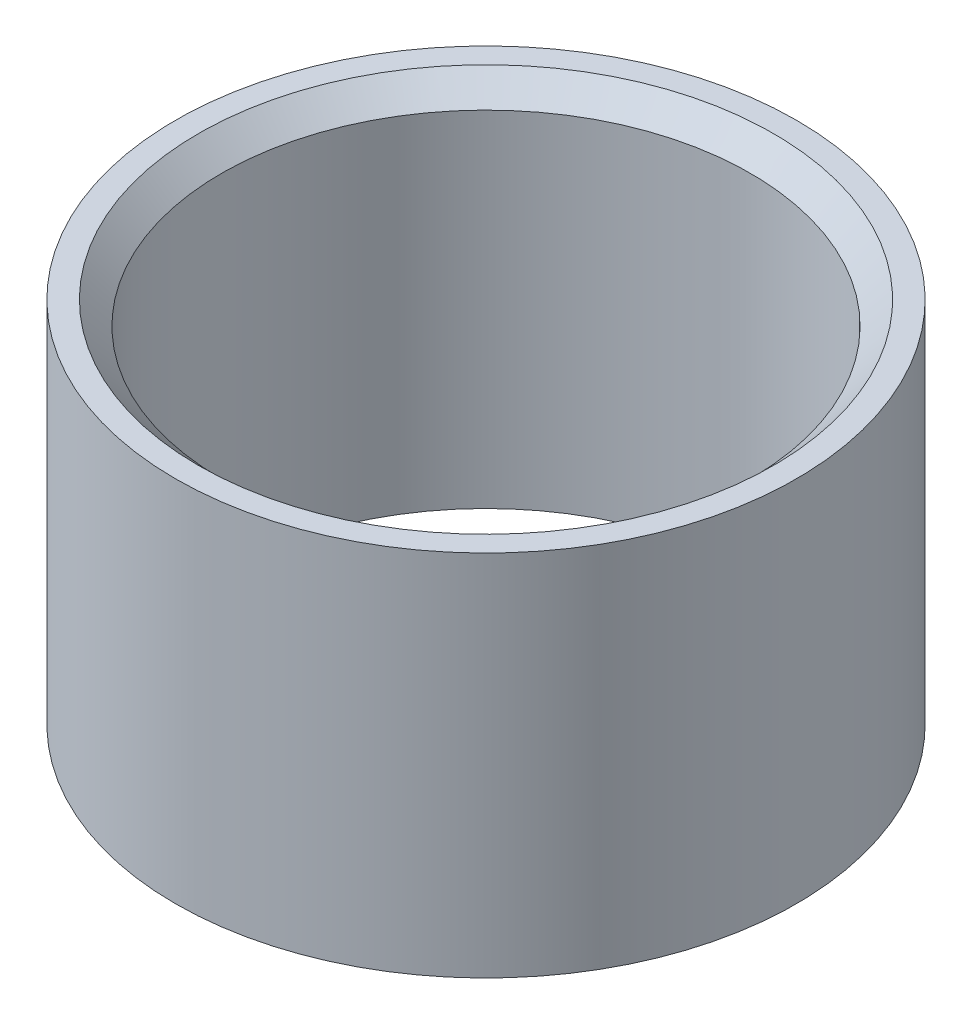
ISO-10303-21;
HEADER;
FILE_DESCRIPTION(('STEP AP214'),'2;1');
FILE_NAME('part.step','',(''),(''),'','','');
FILE_SCHEMA(('AUTOMOTIVE_DESIGN { 1 0 10303 214 1 1 1 1 }'));
ENDSEC;
DATA;
#1=APPLICATION_CONTEXT('core data for automotive mechanical design processes');
#2=APPLICATION_PROTOCOL_DEFINITION('international standard','automotive_design',2000,#1);
#3=PRODUCT_CONTEXT('',#1,'mechanical');
#4=PRODUCT('Part','Part','',(#3));
#5=PRODUCT_RELATED_PRODUCT_CATEGORY('part','',(#4));
#6=PRODUCT_DEFINITION_FORMATION('','',#4);
#7=PRODUCT_DEFINITION_CONTEXT('part definition',#1,'design');
#8=PRODUCT_DEFINITION('design','',#6,#7);
#9=PRODUCT_DEFINITION_SHAPE('','',#8);
#10=(LENGTH_UNIT() NAMED_UNIT(*) SI_UNIT(.MILLI.,.METRE.));
#11=(NAMED_UNIT(*) PLANE_ANGLE_UNIT() SI_UNIT($,.RADIAN.));
#12=(NAMED_UNIT(*) SI_UNIT($,.STERADIAN.) SOLID_ANGLE_UNIT());
#13=UNCERTAINTY_MEASURE_WITH_UNIT(LENGTH_MEASURE(1.E-05),#10,'distance_accuracy_value','');
#14=(GEOMETRIC_REPRESENTATION_CONTEXT(3) GLOBAL_UNCERTAINTY_ASSIGNED_CONTEXT((#13)) GLOBAL_UNIT_ASSIGNED_CONTEXT((#10,
#11,#12)) REPRESENTATION_CONTEXT('',''));
#15=CARTESIAN_POINT('',(0.,0.,0.));
#16=DIRECTION('',(0.,0.,1.));
#17=DIRECTION('',(1.,0.,0.));
#18=AXIS2_PLACEMENT_3D('',#15,#16,#17);
#19=CARTESIAN_POINT('',(0.,1.6,0.));
#20=DIRECTION('',(0.,-1.,0.));
#21=DIRECTION('',(0.,0.,-1.));
#22=AXIS2_PLACEMENT_3D('',#19,#20,#21);
#23=CYLINDRICAL_SURFACE('',#22,1.35);
#24=CARTESIAN_POINT('',(0.,1.6,0.));
#25=DIRECTION('',(0.,1.,0.));
#26=DIRECTION('',(0.,0.,1.));
#27=AXIS2_PLACEMENT_3D('',#24,#25,#26);
#28=CIRCLE('',#27,1.35);
#29=CARTESIAN_POINT('',(0.,1.6,1.35));
#30=VERTEX_POINT('',#29);
#31=EDGE_CURVE('E45',#30,#30,#28,.T.);
#32=ORIENTED_EDGE('',*,*,#31,.F.);
#33=EDGE_LOOP('',(#32));
#34=FACE_BOUND('',#33,.T.);
#35=CARTESIAN_POINT('',(0.,0.,0.));
#36=DIRECTION('',(0.,1.,0.));
#37=DIRECTION('',(0.,0.,1.));
#38=AXIS2_PLACEMENT_3D('',#35,#36,#37);
#39=CIRCLE('',#38,1.35);
#40=CARTESIAN_POINT('',(0.,0.,1.35));
#41=VERTEX_POINT('',#40);
#42=EDGE_CURVE('E49',#41,#41,#39,.T.);
#43=ORIENTED_EDGE('',*,*,#42,.T.);
#44=EDGE_LOOP('',(#43));
#45=FACE_BOUND('',#44,.T.);
#46=ADVANCED_FACE('F34',(#34,#45),#23,.T.);
#47=CARTESIAN_POINT('',(0.,1.6,0.));
#48=DIRECTION('',(0.,1.,0.));
#49=DIRECTION('',(0.,0.,1.));
#50=AXIS2_PLACEMENT_3D('',#47,#48,#49);
#51=PLANE('',#50);
#52=CARTESIAN_POINT('',(0.,1.6,0.));
#53=DIRECTION('',(0.,1.,0.));
#54=DIRECTION('',(0.,0.,1.));
#55=AXIS2_PLACEMENT_3D('',#52,#53,#54);
#56=CIRCLE('',#55,1.25);
#57=CARTESIAN_POINT('',(0.,1.6,1.25));
#58=VERTEX_POINT('',#57);
#59=EDGE_CURVE('E10',#58,#58,#56,.F.);
#60=ORIENTED_EDGE('',*,*,#59,.T.);
#61=EDGE_LOOP('',(#60));
#62=FACE_BOUND('',#61,.T.);
#63=ORIENTED_EDGE('',*,*,#31,.T.);
#64=EDGE_LOOP('',(#63));
#65=FACE_BOUND('',#64,.T.);
#66=ADVANCED_FACE('F69',(#62,#65),#51,.T.);
#67=CARTESIAN_POINT('',(0.,0.,0.));
#68=DIRECTION('',(0.,1.,0.));
#69=DIRECTION('',(0.,0.,1.));
#70=AXIS2_PLACEMENT_3D('',#67,#68,#69);
#71=PLANE('',#70);
#72=CARTESIAN_POINT('',(0.,0.,0.));
#73=DIRECTION('',(0.,1.,0.));
#74=DIRECTION('',(0.,0.,1.));
#75=AXIS2_PLACEMENT_3D('',#72,#73,#74);
#76=CIRCLE('',#75,1.15);
#77=CARTESIAN_POINT('',(0.,0.,1.15));
#78=VERTEX_POINT('',#77);
#79=EDGE_CURVE('E53',#78,#78,#76,.T.);
#80=ORIENTED_EDGE('',*,*,#79,.T.);
#81=EDGE_LOOP('',(#80));
#82=FACE_BOUND('',#81,.T.);
#83=ORIENTED_EDGE('',*,*,#42,.F.);
#84=EDGE_LOOP('',(#83));
#85=FACE_BOUND('',#84,.T.);
#86=ADVANCED_FACE('F58',(#82,#85),#71,.F.);
#87=CARTESIAN_POINT('',(0.,0.,0.));
#88=DIRECTION('',(0.,1.,0.));
#89=DIRECTION('',(0.,0.,1.));
#90=AXIS2_PLACEMENT_3D('',#87,#88,#89);
#91=CYLINDRICAL_SURFACE('',#90,1.15);
#92=CARTESIAN_POINT('',(0.,1.5,0.));
#93=DIRECTION('',(0.,1.,0.));
#94=DIRECTION('',(0.,0.,1.));
#95=AXIS2_PLACEMENT_3D('',#92,#93,#94);
#96=CIRCLE('',#95,1.15);
#97=CARTESIAN_POINT('',(0.,1.5,1.15));
#98=VERTEX_POINT('',#97);
#99=EDGE_CURVE('E41',#98,#98,#96,.T.);
#100=ORIENTED_EDGE('',*,*,#99,.T.);
#101=EDGE_LOOP('',(#100));
#102=FACE_BOUND('',#101,.T.);
#103=ORIENTED_EDGE('',*,*,#79,.F.);
#104=EDGE_LOOP('',(#103));
#105=FACE_BOUND('',#104,.T.);
#106=ADVANCED_FACE('F61',(#102,#105),#91,.F.);
#107=CARTESIAN_POINT('',(0.,1.5,0.));
#108=DIRECTION('',(0.,1.,0.));
#109=DIRECTION('',(0.,0.,1.));
#110=AXIS2_PLACEMENT_3D('',#107,#108,#109);
#111=CONICAL_SURFACE('',#110,1.15,0.785398163397453);
#112=ORIENTED_EDGE('',*,*,#59,.F.);
#113=EDGE_LOOP('',(#112));
#114=FACE_BOUND('',#113,.T.);
#115=ORIENTED_EDGE('',*,*,#99,.F.);
#116=EDGE_LOOP('',(#115));
#117=FACE_BOUND('',#116,.T.);
#118=ADVANCED_FACE('F36',(#114,#117),#111,.F.);
#119=CLOSED_SHELL('',(#46,#66,#86,#106,#118));
#120=MANIFOLD_SOLID_BREP('B2',#119);
#121=ADVANCED_BREP_SHAPE_REPRESENTATION('',(#18,#120),#14);
#122=SHAPE_DEFINITION_REPRESENTATION(#9,#121);
ENDSEC;
END-ISO-10303-21;
